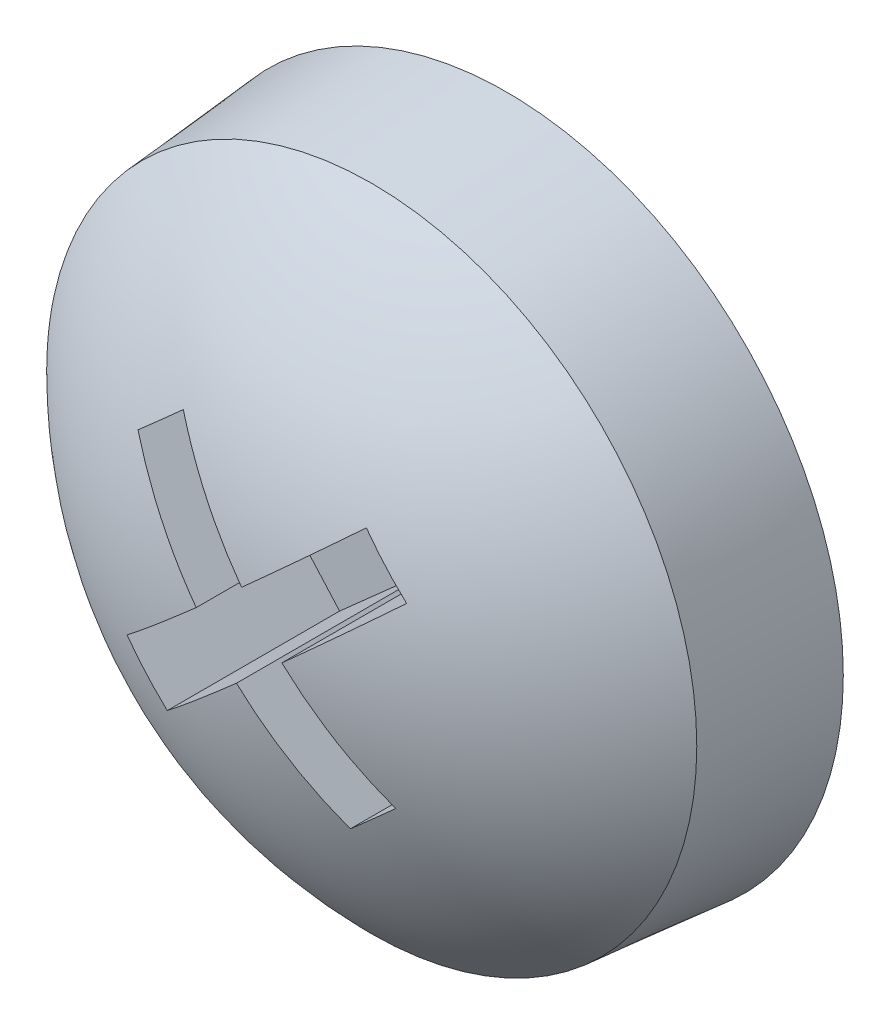
ISO-10303-21;
HEADER;
FILE_DESCRIPTION(('STEP AP214'),'2;1');
FILE_NAME('part.step','',(''),(''),'','','');
FILE_SCHEMA(('AUTOMOTIVE_DESIGN { 1 0 10303 214 1 1 1 1 }'));
ENDSEC;
DATA;
#1=APPLICATION_CONTEXT('core data for automotive mechanical design processes');
#2=APPLICATION_PROTOCOL_DEFINITION('international standard','automotive_design',2000,#1);
#3=PRODUCT_CONTEXT('',#1,'mechanical');
#4=PRODUCT('Part','Part','',(#3));
#5=PRODUCT_RELATED_PRODUCT_CATEGORY('part','',(#4));
#6=PRODUCT_DEFINITION_FORMATION('','',#4);
#7=PRODUCT_DEFINITION_CONTEXT('part definition',#1,'design');
#8=PRODUCT_DEFINITION('design','',#6,#7);
#9=PRODUCT_DEFINITION_SHAPE('','',#8);
#10=(LENGTH_UNIT() NAMED_UNIT(*) SI_UNIT(.MILLI.,.METRE.));
#11=(NAMED_UNIT(*) PLANE_ANGLE_UNIT() SI_UNIT($,.RADIAN.));
#12=(NAMED_UNIT(*) SI_UNIT($,.STERADIAN.) SOLID_ANGLE_UNIT());
#13=UNCERTAINTY_MEASURE_WITH_UNIT(LENGTH_MEASURE(1.E-05),#10,'distance_accuracy_value','');
#14=(GEOMETRIC_REPRESENTATION_CONTEXT(3) GLOBAL_UNCERTAINTY_ASSIGNED_CONTEXT((#13)) GLOBAL_UNIT_ASSIGNED_CONTEXT((#10,
#11,#12)) REPRESENTATION_CONTEXT('',''));
#15=CARTESIAN_POINT('',(0.,0.,0.));
#16=DIRECTION('',(0.,0.,1.));
#17=DIRECTION('',(1.,0.,0.));
#18=AXIS2_PLACEMENT_3D('',#15,#16,#17);
#19=CARTESIAN_POINT('',(-6.90000000000015,4.50499199787339,21.6));
#20=DIRECTION('',(0.,0.,1.));
#21=DIRECTION('',(0.,-1.,0.));
#22=AXIS2_PLACEMENT_3D('',#19,#20,#21);
#23=PLANE('',#22);
#24=DIRECTION('',(0.747876143588401,0.66383828893138,0.));
#25=VECTOR('',#24,1.);
#26=CARTESIAN_POINT('',(-7.0194908920078,4.6396097037193,21.6));
#27=LINE('',#26,#25);
#28=CARTESIAN_POINT('',(-6.88487318616189,4.75910059572695,21.6));
#29=VERTEX_POINT('',#28);
#30=CARTESIAN_POINT('',(-6.30900855559882,5.27025607820411,21.6));
#31=VERTEX_POINT('',#30);
#32=EDGE_CURVE('E84',#29,#31,#27,.T.);
#33=ORIENTED_EDGE('',*,*,#32,.F.);
#34=DIRECTION('',(0.66383828893138,-0.747876143588401,0.));
#35=VECTOR('',#34,1.);
#36=CARTESIAN_POINT('',(-6.76538229415424,4.62448288988104,21.6));
#37=LINE('',#36,#35);
#38=CARTESIAN_POINT('',(-7.39602866863905,5.33496522629002,21.6));
#39=VERTEX_POINT('',#38);
#40=EDGE_CURVE('E89',#39,#29,#37,.T.);
#41=ORIENTED_EDGE('',*,*,#40,.F.);
#42=DIRECTION('',(0.747876143588401,0.66383828893138,0.));
#43=VECTOR('',#42,1.);
#44=CARTESIAN_POINT('',(-7.53064637448496,5.21547433428237,21.6));
#45=LINE('',#44,#43);
#46=CARTESIAN_POINT('',(-7.66526408033088,5.09598344227472,21.6));
#47=VERTEX_POINT('',#46);
#48=EDGE_CURVE('E140',#47,#39,#45,.T.);
#49=ORIENTED_EDGE('',*,*,#48,.F.);
#50=DIRECTION('',(-0.66383828893138,0.747876143588401,0.));
#51=VECTOR('',#50,1.);
#52=CARTESIAN_POINT('',(-7.03461770584607,4.38550110586574,21.6));
#53=LINE('',#52,#51);
#54=CARTESIAN_POINT('',(-7.15410859785371,4.52011881171165,21.6));
#55=VERTEX_POINT('',#54);
#56=EDGE_CURVE('E151',#55,#47,#53,.T.);
#57=ORIENTED_EDGE('',*,*,#56,.F.);
#58=DIRECTION('',(0.747876143588401,0.66383828893138,0.));
#59=VECTOR('',#58,1.);
#60=CARTESIAN_POINT('',(-7.0194908920078,4.6396097037193,21.6));
#61=LINE('',#60,#59);
#62=CARTESIAN_POINT('',(-7.72997322841678,4.00896332923449,21.6));
#63=VERTEX_POINT('',#62);
#64=EDGE_CURVE('E154',#63,#55,#61,.T.);
#65=ORIENTED_EDGE('',*,*,#64,.F.);
#66=DIRECTION('',(-0.66383828893138,0.747876143588401,0.));
#67=VECTOR('',#66,1.);
#68=CARTESIAN_POINT('',(-7.61048233640913,3.87434562338858,21.6));
#69=LINE('',#68,#67);
#70=CARTESIAN_POINT('',(-7.49099144440148,3.73972791754267,21.6));
#71=VERTEX_POINT('',#70);
#72=EDGE_CURVE('E162',#71,#63,#69,.T.);
#73=ORIENTED_EDGE('',*,*,#72,.F.);
#74=DIRECTION('',(-0.747876143588401,-0.66383828893138,0.));
#75=VECTOR('',#74,1.);
#76=CARTESIAN_POINT('',(-6.7805091079925,4.37037429202748,21.6));
#77=LINE('',#76,#75);
#78=CARTESIAN_POINT('',(-6.91512681383842,4.25088340001983,21.6));
#79=VERTEX_POINT('',#78);
#80=EDGE_CURVE('E167',#79,#71,#77,.T.);
#81=ORIENTED_EDGE('',*,*,#80,.F.);
#82=DIRECTION('',(-0.66383828893138,0.747876143588401,0.));
#83=VECTOR('',#82,1.);
#84=CARTESIAN_POINT('',(-7.03461770584607,4.38550110586574,21.6));
#85=LINE('',#84,#83);
#86=CARTESIAN_POINT('',(-6.40397133136126,3.67501876945676,21.6));
#87=VERTEX_POINT('',#86);
#88=EDGE_CURVE('E172',#87,#79,#85,.T.);
#89=ORIENTED_EDGE('',*,*,#88,.F.);
#90=DIRECTION('',(0.747876143588401,0.66383828893138,0.));
#91=VECTOR('',#90,1.);
#92=CARTESIAN_POINT('',(-6.26935362551535,3.79450966146441,21.6));
#93=LINE('',#92,#91);
#94=CARTESIAN_POINT('',(-6.13473591966944,3.91400055347207,21.6));
#95=VERTEX_POINT('',#94);
#96=EDGE_CURVE('E178',#87,#95,#93,.T.);
#97=ORIENTED_EDGE('',*,*,#96,.T.);
#98=DIRECTION('',(0.66383828893138,-0.747876143588401,0.));
#99=VECTOR('',#98,1.);
#100=CARTESIAN_POINT('',(-6.76538229415424,4.62448288988104,21.6));
#101=LINE('',#100,#99);
#102=CARTESIAN_POINT('',(-6.64589140214659,4.48986518403512,21.6));
#103=VERTEX_POINT('',#102);
#104=EDGE_CURVE('E183',#103,#95,#101,.T.);
#105=ORIENTED_EDGE('',*,*,#104,.F.);
#106=DIRECTION('',(-0.747876143588401,-0.66383828893138,0.));
#107=VECTOR('',#106,1.);
#108=CARTESIAN_POINT('',(-6.7805091079925,4.37037429202748,21.6));
#109=LINE('',#108,#107);
#110=CARTESIAN_POINT('',(-6.07002677158353,5.00102066651228,21.6));
#111=VERTEX_POINT('',#110);
#112=EDGE_CURVE('E119',#111,#103,#109,.T.);
#113=ORIENTED_EDGE('',*,*,#112,.F.);
#114=DIRECTION('',(-0.66383828893138,0.747876143588401,0.));
#115=VECTOR('',#114,1.);
#116=CARTESIAN_POINT('',(-6.18951766359117,5.1356383723582,21.6));
#117=LINE('',#116,#115);
#118=EDGE_CURVE('E117',#111,#31,#117,.T.);
#119=ORIENTED_EDGE('',*,*,#118,.T.);
#120=EDGE_LOOP('',(#33,#41,#49,#57,#65,#73,#81,#89,#97,#105,#113,#119));
#121=FACE_BOUND('',#120,.T.);
#122=ADVANCED_FACE('F17',(#121),#23,.T.);
#123=CARTESIAN_POINT('',(-7.0194908920078,4.6396097037193,22.2));
#124=DIRECTION('',(0.66383828893138,-0.747876143588401,0.));
#125=DIRECTION('',(0.747876143588401,0.66383828893138,0.));
#126=AXIS2_PLACEMENT_3D('',#123,#124,#125);
#127=PLANE('',#126);
#128=DIRECTION('',(0.,0.,1.));
#129=VECTOR('',#128,1.);
#130=CARTESIAN_POINT('',(-6.88487318616189,4.75910059572695,22.2));
#131=LINE('',#130,#129);
#132=CARTESIAN_POINT('',(-6.88487318616189,4.75910059572695,22.788097569794));
#133=VERTEX_POINT('',#132);
#134=EDGE_CURVE('E127',#29,#133,#131,.T.);
#135=ORIENTED_EDGE('',*,*,#134,.F.);
#136=ORIENTED_EDGE('',*,*,#32,.T.);
#137=DIRECTION('',(0.,0.,1.));
#138=VECTOR('',#137,1.);
#139=CARTESIAN_POINT('',(-6.30900855559882,5.27025607820411,22.2));
#140=LINE('',#139,#138);
#141=CARTESIAN_POINT('',(-6.30900855559882,5.27025607820411,22.6229045231911));
#142=VERTEX_POINT('',#141);
#143=EDGE_CURVE('E123',#31,#142,#140,.T.);
#144=ORIENTED_EDGE('',*,*,#143,.T.);
#145=CARTESIAN_POINT('',(-6.88487318616188,4.75910059572695,22.788097569794));
#146=CARTESIAN_POINT('',(-6.86018725238199,4.78101260372668,22.7859104299673));
#147=CARTESIAN_POINT('',(-6.83553118762501,4.80289809904616,22.7831210421487));
#148=CARTESIAN_POINT('',(-6.78640820570417,4.84650119635726,22.7763560552392));
#149=CARTESIAN_POINT('',(-6.76194092600565,4.868219120146,22.7723851623111));
#150=CARTESIAN_POINT('',(-6.71319426733734,4.91148818115152,22.7632701136372));
#151=CARTESIAN_POINT('',(-6.68891456403112,4.93303960625946,22.7581290588921));
#152=CARTESIAN_POINT('',(-6.64054218782471,4.97597644242906,22.7466823115268));
#153=CARTESIAN_POINT('',(-6.61644931068595,4.99736203477927,22.7403781619621));
#154=CARTESIAN_POINT('',(-6.56844981562365,5.03996788996652,22.7266089835755));
#155=CARTESIAN_POINT('',(-6.54454319770011,5.06118815280357,22.7191439547536));
#156=CARTESIAN_POINT('',(-6.4969160965814,5.10346345946291,22.703052205587));
#157=CARTESIAN_POINT('',(-6.47319590048996,5.12451824844295,22.6944239659575));
#158=CARTESIAN_POINT('',(-6.42594275839351,5.16646161736154,22.6760004253173));
#159=CARTESIAN_POINT('',(-6.40241046789994,5.1873496154476,22.666202118307));
#160=CARTESIAN_POINT('',(-6.35553505693748,5.22895769838091,22.6454289197685));
#161=CARTESIAN_POINT('',(-6.332193049565,5.24967679520893,22.6344495373844));
#162=CARTESIAN_POINT('',(-6.30900855559883,5.2702560782041,22.622904523191));
#163=B_SPLINE_CURVE_WITH_KNOTS('',3,(#145,#146,#147,#148,#149,#150,#151,#152,#153,#154,#155,
#156,#157,#158,#159,#160,#161,#162),.UNSPECIFIED.,.F.,.F.,(4,2,2,2,2,2,2,2,4),(0.,
0.0992357442434154,0.198081387639264,0.296668072480489,0.395124892694087,0.493581712907685,
0.592168397748909,0.691014041144759,0.790249785388174),.UNSPECIFIED.);
#164=EDGE_CURVE('E20',#133,#142,#163,.T.);
#165=ORIENTED_EDGE('',*,*,#164,.F.);
#166=EDGE_LOOP('',(#135,#136,#144,#165));
#167=FACE_BOUND('',#166,.T.);
#168=ADVANCED_FACE('F125',(#167),#127,.T.);
#169=CARTESIAN_POINT('',(-6.18951766359117,5.1356383723582,22.2));
#170=DIRECTION('',(0.747876143588401,0.66383828893138,0.));
#171=DIRECTION('',(-0.66383828893138,0.747876143588401,0.));
#172=AXIS2_PLACEMENT_3D('',#169,#170,#171);
#173=PLANE('',#172);
#174=ORIENTED_EDGE('',*,*,#118,.F.);
#175=DIRECTION('',(0.,0.,1.));
#176=VECTOR('',#175,1.);
#177=CARTESIAN_POINT('',(-6.07002677158353,5.00102066651228,22.2));
#178=LINE('',#177,#176);
#179=CARTESIAN_POINT('',(-6.07002677158354,5.00102066651227,22.6229045231911));
#180=VERTEX_POINT('',#179);
#181=EDGE_CURVE('E132',#180,#111,#178,.F.);
#182=ORIENTED_EDGE('',*,*,#181,.F.);
#183=CARTESIAN_POINT('',(-6.30900855559881,5.27025607820411,22.622904523191));
#184=CARTESIAN_POINT('',(-6.26917825826292,5.22538350958884,22.6271329188894));
#185=CARTESIAN_POINT('',(-6.22934796092705,5.18051094097354,22.6292471167385));
#186=CARTESIAN_POINT('',(-6.14968736625535,5.09076580374292,22.6292471167385));
#187=CARTESIAN_POINT('',(-6.10985706891952,5.04589323512759,22.6271329188894));
#188=CARTESIAN_POINT('',(-6.0700267715837,5.00102066651225,22.6229045231911));
#189=B_SPLINE_CURVE_WITH_KNOTS('',3,(#183,#184,#185,#186,#187,#188),.UNSPECIFIED.,.F.,.F.,(4,2,
4),(0.,0.180111711148641,0.360223422297283),.UNSPECIFIED.);
#190=EDGE_CURVE('E131',#142,#180,#189,.T.);
#191=ORIENTED_EDGE('',*,*,#190,.F.);
#192=ORIENTED_EDGE('',*,*,#143,.F.);
#193=EDGE_LOOP('',(#174,#182,#191,#192));
#194=FACE_BOUND('',#193,.T.);
#195=ADVANCED_FACE('F129',(#194),#173,.F.);
#196=CARTESIAN_POINT('',(-6.7805091079925,4.37037429202748,22.2));
#197=DIRECTION('',(-0.66383828893138,0.747876143588401,0.));
#198=DIRECTION('',(-0.747876143588401,-0.66383828893138,0.));
#199=AXIS2_PLACEMENT_3D('',#196,#197,#198);
#200=PLANE('',#199);
#201=DIRECTION('',(0.,0.,1.));
#202=VECTOR('',#201,1.);
#203=CARTESIAN_POINT('',(-6.64589140214659,4.48986518403512,22.2));
#204=LINE('',#203,#202);
#205=CARTESIAN_POINT('',(-6.64589140214659,4.48986518403512,22.788097569794));
#206=VERTEX_POINT('',#205);
#207=EDGE_CURVE('E180',#206,#103,#204,.F.);
#208=ORIENTED_EDGE('',*,*,#207,.F.);
#209=CARTESIAN_POINT('',(-6.07002677158354,5.00102066651227,22.622904523191));
#210=CARTESIAN_POINT('',(-6.09321126554971,4.9804413835171,22.6344495373844));
#211=CARTESIAN_POINT('',(-6.11655327292219,4.95972228668908,22.6454289197685));
#212=CARTESIAN_POINT('',(-6.16342868388464,4.91811420375578,22.666202118307));
#213=CARTESIAN_POINT('',(-6.18696097437822,4.89722620566971,22.6760004253173));
#214=CARTESIAN_POINT('',(-6.23421411647466,4.85528283675112,22.6944239659575));
#215=CARTESIAN_POINT('',(-6.25793431256611,4.83422804777108,22.703052205587));
#216=CARTESIAN_POINT('',(-6.30556141368481,4.79195274111174,22.7191439547536));
#217=CARTESIAN_POINT('',(-6.32946803160836,4.7707324782747,22.7266089835755));
#218=CARTESIAN_POINT('',(-6.37746752667066,4.72812662308744,22.7403781619621));
#219=CARTESIAN_POINT('',(-6.40156040380942,4.70674103073723,22.7466823115268));
#220=CARTESIAN_POINT('',(-6.44993278001582,4.66380419456764,22.7581290588921));
#221=CARTESIAN_POINT('',(-6.47421248332205,4.64225276945969,22.7632701136372));
#222=CARTESIAN_POINT('',(-6.52295914199036,4.59898370845418,22.7723851623111));
#223=CARTESIAN_POINT('',(-6.54742642168888,4.57726578466544,22.7763560552392));
#224=CARTESIAN_POINT('',(-6.59654940360971,4.53366268735434,22.7831210421487));
#225=CARTESIAN_POINT('',(-6.6212054683667,4.51177719203486,22.7859104299673));
#226=CARTESIAN_POINT('',(-6.64589140214659,4.48986518403512,22.788097569794));
#227=B_SPLINE_CURVE_WITH_KNOTS('',3,(#209,#210,#211,#212,#213,#214,#215,#216,#217,#218,#219,
#220,#221,#222,#223,#224,#225,#226),.UNSPECIFIED.,.F.,.F.,(4,2,2,2,2,2,2,2,4),(0.,
0.0992357442434141,0.198081387639263,0.296668072480486,0.395124892694084,0.493581712907682,
0.592168397748907,0.691014041144756,0.79024978538817),.UNSPECIFIED.);
#228=EDGE_CURVE('E296',#180,#206,#227,.T.);
#229=ORIENTED_EDGE('',*,*,#228,.F.);
#230=ORIENTED_EDGE('',*,*,#181,.T.);
#231=ORIENTED_EDGE('',*,*,#112,.T.);
#232=EDGE_LOOP('',(#208,#229,#230,#231));
#233=FACE_BOUND('',#232,.T.);
#234=ADVANCED_FACE('F305',(#233),#200,.T.);
#235=CARTESIAN_POINT('',(-6.76538229415424,4.62448288988104,22.2));
#236=DIRECTION('',(-0.747876143588401,-0.66383828893138,0.));
#237=DIRECTION('',(0.66383828893138,-0.747876143588401,0.));
#238=AXIS2_PLACEMENT_3D('',#235,#236,#237);
#239=PLANE('',#238);
#240=CARTESIAN_POINT('',(-6.64589140214659,4.48986518403512,22.788097569794));
#241=CARTESIAN_POINT('',(-6.62397939414685,4.46517925025523,22.7859104299673));
#242=CARTESIAN_POINT('',(-6.60209389882737,4.44052318549825,22.7831210421487));
#243=CARTESIAN_POINT('',(-6.55849080151628,4.39140020357741,22.7763560552392));
#244=CARTESIAN_POINT('',(-6.53677287772753,4.36693292387889,22.7723851623111));
#245=CARTESIAN_POINT('',(-6.49350381672202,4.31818626521058,22.7632701136372));
#246=CARTESIAN_POINT('',(-6.47195239161407,4.29390656190436,22.7581290588921));
#247=CARTESIAN_POINT('',(-6.42901555544448,4.24553418569795,22.7466823115268));
#248=CARTESIAN_POINT('',(-6.40762996309427,4.22144130855919,22.740378161962));
#249=CARTESIAN_POINT('',(-6.36502410790701,4.17344181349689,22.7266089835755));
#250=CARTESIAN_POINT('',(-6.34380384506997,4.14953519557335,22.7191439547536));
#251=CARTESIAN_POINT('',(-6.30152853841063,4.10190809445464,22.703052205587));
#252=CARTESIAN_POINT('',(-6.28047374943059,4.0781878983632,22.6944239659575));
#253=CARTESIAN_POINT('',(-6.23853038051201,4.03093475626675,22.6760004253173));
#254=CARTESIAN_POINT('',(-6.21764238242594,4.00740246577318,22.666202118307));
#255=CARTESIAN_POINT('',(-6.17603429949263,3.96052705481073,22.6454289197685));
#256=CARTESIAN_POINT('',(-6.15531520266462,3.93718504743825,22.6344495373844));
#257=CARTESIAN_POINT('',(-6.13473591966945,3.91400055347208,22.622904523191));
#258=B_SPLINE_CURVE_WITH_KNOTS('',3,(#240,#241,#242,#243,#244,#245,#246,#247,#248,#249,#250,
#251,#252,#253,#254,#255,#256,#257),.UNSPECIFIED.,.F.,.F.,(4,2,2,2,2,2,2,2,4),(0.,
0.0992357442434136,0.198081387639262,0.296668072480486,0.395124892694082,0.49358171290768,
0.592168397748903,0.691014041144751,0.790249785388165),.UNSPECIFIED.);
#259=CARTESIAN_POINT('',(-6.13473591966943,3.91400055347206,22.6229045231911));
#260=VERTEX_POINT('',#259);
#261=EDGE_CURVE('E289',#206,#260,#258,.T.);
#262=ORIENTED_EDGE('',*,*,#261,.F.);
#263=ORIENTED_EDGE('',*,*,#207,.T.);
#264=ORIENTED_EDGE('',*,*,#104,.T.);
#265=DIRECTION('',(0.,0.,1.));
#266=VECTOR('',#265,1.);
#267=CARTESIAN_POINT('',(-6.13473591966943,3.91400055347206,22.2));
#268=LINE('',#267,#266);
#269=EDGE_CURVE('E175',#95,#260,#268,.T.);
#270=ORIENTED_EDGE('',*,*,#269,.T.);
#271=EDGE_LOOP('',(#262,#263,#264,#270));
#272=FACE_BOUND('',#271,.T.);
#273=ADVANCED_FACE('F302',(#272),#239,.T.);
#274=CARTESIAN_POINT('',(-6.26935362551535,3.79450966146441,22.2));
#275=DIRECTION('',(0.66383828893138,-0.747876143588401,0.));
#276=DIRECTION('',(0.747876143588401,0.66383828893138,0.));
#277=AXIS2_PLACEMENT_3D('',#274,#275,#276);
#278=PLANE('',#277);
#279=ORIENTED_EDGE('',*,*,#96,.F.);
#280=DIRECTION('',(0.,0.,1.));
#281=VECTOR('',#280,1.);
#282=CARTESIAN_POINT('',(-6.40397133136126,3.67501876945676,22.2));
#283=LINE('',#282,#281);
#284=CARTESIAN_POINT('',(-6.40397133136127,3.67501876945677,22.6229045231911));
#285=VERTEX_POINT('',#284);
#286=EDGE_CURVE('E174',#285,#87,#283,.F.);
#287=ORIENTED_EDGE('',*,*,#286,.F.);
#288=CARTESIAN_POINT('',(-6.13473591966944,3.91400055347206,22.622904523191));
#289=CARTESIAN_POINT('',(-6.17960848828474,3.87417025613618,22.6271329188894));
#290=CARTESIAN_POINT('',(-6.22448105690004,3.83433995880029,22.6292471167385));
#291=CARTESIAN_POINT('',(-6.31422619413065,3.75467936412853,22.6292471167385));
#292=CARTESIAN_POINT('',(-6.35909876274595,3.71484906679265,22.6271329188894));
#293=CARTESIAN_POINT('',(-6.40397133136126,3.67501876945677,22.622904523191));
#294=B_SPLINE_CURVE_WITH_KNOTS('',3,(#288,#289,#290,#291,#292,#293),.UNSPECIFIED.,.F.,.F.,(4,2,
4),(0.,0.180111711148687,0.360223422297372),.UNSPECIFIED.);
#295=EDGE_CURVE('E282',#260,#285,#294,.T.);
#296=ORIENTED_EDGE('',*,*,#295,.F.);
#297=ORIENTED_EDGE('',*,*,#269,.F.);
#298=EDGE_LOOP('',(#279,#287,#296,#297));
#299=FACE_BOUND('',#298,.T.);
#300=ADVANCED_FACE('F271',(#299),#278,.F.);
#301=CARTESIAN_POINT('',(-7.03461770584607,4.38550110586574,22.2));
#302=DIRECTION('',(0.747876143588401,0.66383828893138,0.));
#303=DIRECTION('',(-0.66383828893138,0.747876143588401,0.));
#304=AXIS2_PLACEMENT_3D('',#301,#302,#303);
#305=PLANE('',#304);
#306=CARTESIAN_POINT('',(-6.40397133136128,3.67501876945678,22.622904523191));
#307=CARTESIAN_POINT('',(-6.42455061435645,3.69820326342295,22.6344495373844));
#308=CARTESIAN_POINT('',(-6.44526971118446,3.72154527079543,22.6454289197685));
#309=CARTESIAN_POINT('',(-6.48687779411777,3.76842068175788,22.666202118307));
#310=CARTESIAN_POINT('',(-6.50776579220384,3.79195297225145,22.6760004253173));
#311=CARTESIAN_POINT('',(-6.54970916112242,3.8392061143479,22.6944239659575));
#312=CARTESIAN_POINT('',(-6.57076395010246,3.86292631043934,22.703052205587));
#313=CARTESIAN_POINT('',(-6.6130392567618,3.91055341155805,22.7191439547536));
#314=CARTESIAN_POINT('',(-6.63425951959885,3.93446002948159,22.7266089835755));
#315=CARTESIAN_POINT('',(-6.6768653747861,3.9824595245439,22.740378161962));
#316=CARTESIAN_POINT('',(-6.69825096713631,4.00655240168266,22.7466823115268));
#317=CARTESIAN_POINT('',(-6.74118780330591,4.05492477788906,22.7581290588921));
#318=CARTESIAN_POINT('',(-6.76273922841385,4.07920448119528,22.7632701136372));
#319=CARTESIAN_POINT('',(-6.80600828941937,4.1279511398636,22.7723851623111));
#320=CARTESIAN_POINT('',(-6.82772621320811,4.15241841956212,22.7763560552392));
#321=CARTESIAN_POINT('',(-6.87132931051921,4.20154140148295,22.7831210421487));
#322=CARTESIAN_POINT('',(-6.89321480583869,4.22619746623993,22.7859104299673));
#323=CARTESIAN_POINT('',(-6.91512681383842,4.25088340001983,22.788097569794));
#324=B_SPLINE_CURVE_WITH_KNOTS('',3,(#306,#307,#308,#309,#310,#311,#312,#313,#314,#315,#316,
#317,#318,#319,#320,#321,#322,#323),.UNSPECIFIED.,.F.,.F.,(4,2,2,2,2,2,2,2,4),(0.,
0.099235744243414,0.198081387639263,0.296668072480486,0.395124892694086,0.493581712907683,
0.592168397748909,0.691014041144756,0.790249785388172),.UNSPECIFIED.);
#325=CARTESIAN_POINT('',(-6.91512681383842,4.25088340001983,22.788097569794));
#326=VERTEX_POINT('',#325);
#327=EDGE_CURVE('E275',#285,#326,#324,.T.);
#328=ORIENTED_EDGE('',*,*,#327,.F.);
#329=ORIENTED_EDGE('',*,*,#286,.T.);
#330=ORIENTED_EDGE('',*,*,#88,.T.);
#331=DIRECTION('',(0.,0.,1.));
#332=VECTOR('',#331,1.);
#333=CARTESIAN_POINT('',(-6.91512681383842,4.25088340001983,22.2));
#334=LINE('',#333,#332);
#335=EDGE_CURVE('E169',#326,#79,#334,.F.);
#336=ORIENTED_EDGE('',*,*,#335,.F.);
#337=EDGE_LOOP('',(#328,#329,#330,#336));
#338=FACE_BOUND('',#337,.T.);
#339=ADVANCED_FACE('F266',(#338),#305,.T.);
#340=CARTESIAN_POINT('',(-6.7805091079925,4.37037429202748,22.2));
#341=DIRECTION('',(-0.66383828893138,0.747876143588401,0.));
#342=DIRECTION('',(-0.747876143588401,-0.66383828893138,0.));
#343=AXIS2_PLACEMENT_3D('',#340,#341,#342);
#344=PLANE('',#343);
#345=ORIENTED_EDGE('',*,*,#335,.T.);
#346=ORIENTED_EDGE('',*,*,#80,.T.);
#347=DIRECTION('',(0.,0.,1.));
#348=VECTOR('',#347,1.);
#349=CARTESIAN_POINT('',(-7.49099144440148,3.73972791754267,22.2));
#350=LINE('',#349,#348);
#351=CARTESIAN_POINT('',(-7.49099144440148,3.73972791754267,22.6229045231911));
#352=VERTEX_POINT('',#351);
#353=EDGE_CURVE('E164',#352,#71,#350,.F.);
#354=ORIENTED_EDGE('',*,*,#353,.F.);
#355=CARTESIAN_POINT('',(-6.91512681383842,4.25088340001983,22.788097569794));
#356=CARTESIAN_POINT('',(-6.93981274761831,4.22897139202009,22.7859104299673));
#357=CARTESIAN_POINT('',(-6.96446881237529,4.20708589670061,22.7831210421487));
#358=CARTESIAN_POINT('',(-7.01359179429613,4.16348279938951,22.7763560552392));
#359=CARTESIAN_POINT('',(-7.03805907399465,4.14176487560077,22.7723851623111));
#360=CARTESIAN_POINT('',(-7.08680573266296,4.09849581459526,22.7632701136372));
#361=CARTESIAN_POINT('',(-7.11108543596918,4.07694438948731,22.7581290588921));
#362=CARTESIAN_POINT('',(-7.15945781217559,4.03400755331772,22.7466823115268));
#363=CARTESIAN_POINT('',(-7.18355068931435,4.01262196096751,22.740378161962));
#364=CARTESIAN_POINT('',(-7.23155018437665,3.97001610578025,22.7266089835755));
#365=CARTESIAN_POINT('',(-7.25545680230019,3.94879584294321,22.7191439547536));
#366=CARTESIAN_POINT('',(-7.3030839034189,3.90652053628387,22.703052205587));
#367=CARTESIAN_POINT('',(-7.32680409951034,3.88546574730383,22.6944239659575));
#368=CARTESIAN_POINT('',(-7.37405724160679,3.84352237838524,22.6760004253173));
#369=CARTESIAN_POINT('',(-7.39758953210036,3.82263438029918,22.666202118307));
#370=CARTESIAN_POINT('',(-7.44446494306281,3.78102629736587,22.6454289197685));
#371=CARTESIAN_POINT('',(-7.46780695043529,3.76030720053786,22.6344495373844));
#372=CARTESIAN_POINT('',(-7.49099144440146,3.73972791754268,22.622904523191));
#373=B_SPLINE_CURVE_WITH_KNOTS('',3,(#355,#356,#357,#358,#359,#360,#361,#362,#363,#364,#365,
#366,#367,#368,#369,#370,#371,#372),.UNSPECIFIED.,.F.,.F.,(4,2,2,2,2,2,2,2,4),(0.,
0.0992357442434149,0.198081387639262,0.296668072480486,0.395124892694082,0.493581712907681,
0.592168397748905,0.691014041144753,0.790249785388167),.UNSPECIFIED.);
#374=EDGE_CURVE('E251',#326,#352,#373,.T.);
#375=ORIENTED_EDGE('',*,*,#374,.F.);
#376=EDGE_LOOP('',(#345,#346,#354,#375));
#377=FACE_BOUND('',#376,.T.);
#378=ADVANCED_FACE('F261',(#377),#344,.T.);
#379=CARTESIAN_POINT('',(-7.61048233640913,3.87434562338858,22.2));
#380=DIRECTION('',(0.747876143588401,0.66383828893138,0.));
#381=DIRECTION('',(-0.66383828893138,0.747876143588401,0.));
#382=AXIS2_PLACEMENT_3D('',#379,#380,#381);
#383=PLANE('',#382);
#384=ORIENTED_EDGE('',*,*,#353,.T.);
#385=ORIENTED_EDGE('',*,*,#72,.T.);
#386=DIRECTION('',(0.,0.,1.));
#387=VECTOR('',#386,1.);
#388=CARTESIAN_POINT('',(-7.72997322841678,4.00896332923449,22.2));
#389=LINE('',#388,#387);
#390=CARTESIAN_POINT('',(-7.72997322841677,4.0089633292345,22.6229045231911));
#391=VERTEX_POINT('',#390);
#392=EDGE_CURVE('E159',#391,#63,#389,.F.);
#393=ORIENTED_EDGE('',*,*,#392,.F.);
#394=CARTESIAN_POINT('',(-7.49099144440148,3.73972791754267,22.622904523191));
#395=CARTESIAN_POINT('',(-7.53082174173737,3.78460048615797,22.6271329188894));
#396=CARTESIAN_POINT('',(-7.57065203907325,3.82947305477328,22.6292471167385));
#397=CARTESIAN_POINT('',(-7.65031263374502,3.91921819200389,22.6292471167385));
#398=CARTESIAN_POINT('',(-7.6901429310809,3.9640907606192,22.6271329188894));
#399=CARTESIAN_POINT('',(-7.72997322841678,4.0089633292345,22.622904523191));
#400=B_SPLINE_CURVE_WITH_KNOTS('',3,(#394,#395,#396,#397,#398,#399),.UNSPECIFIED.,.F.,.F.,(4,2,
4),(0.,0.180111711148691,0.360223422297383),.UNSPECIFIED.);
#401=EDGE_CURVE('E244',#352,#391,#400,.T.);
#402=ORIENTED_EDGE('',*,*,#401,.F.);
#403=EDGE_LOOP('',(#384,#385,#393,#402));
#404=FACE_BOUND('',#403,.T.);
#405=ADVANCED_FACE('F258',(#404),#383,.T.);
#406=CARTESIAN_POINT('',(-7.0194908920078,4.6396097037193,22.2));
#407=DIRECTION('',(0.66383828893138,-0.747876143588401,0.));
#408=DIRECTION('',(0.747876143588401,0.66383828893138,0.));
#409=AXIS2_PLACEMENT_3D('',#406,#407,#408);
#410=PLANE('',#409);
#411=DIRECTION('',(0.,0.,1.));
#412=VECTOR('',#411,1.);
#413=CARTESIAN_POINT('',(-7.15410859785371,4.52011881171165,22.2));
#414=LINE('',#413,#412);
#415=CARTESIAN_POINT('',(-7.15410859785371,4.52011881171165,22.788097569794));
#416=VERTEX_POINT('',#415);
#417=EDGE_CURVE('E143',#416,#55,#414,.F.);
#418=ORIENTED_EDGE('',*,*,#417,.F.);
#419=CARTESIAN_POINT('',(-7.72997322841676,4.0089633292345,22.622904523191));
#420=CARTESIAN_POINT('',(-7.70678873445059,4.02954261222968,22.6344495373844));
#421=CARTESIAN_POINT('',(-7.68344672707811,4.05026170905769,22.6454289197685));
#422=CARTESIAN_POINT('',(-7.63657131611566,4.091869791991,22.666202118307));
#423=CARTESIAN_POINT('',(-7.61303902562209,4.11275779007707,22.6760004253173));
#424=CARTESIAN_POINT('',(-7.56578588352564,4.15470115899565,22.6944239659575));
#425=CARTESIAN_POINT('',(-7.54206568743419,4.17575594797569,22.703052205587));
#426=CARTESIAN_POINT('',(-7.49443858631549,4.21803125463503,22.7191439547536));
#427=CARTESIAN_POINT('',(-7.47053196839195,4.23925151747208,22.7266089835755));
#428=CARTESIAN_POINT('',(-7.42253247332965,4.28185737265933,22.740378161962));
#429=CARTESIAN_POINT('',(-7.39843959619089,4.30324296500954,22.7466823115268));
#430=CARTESIAN_POINT('',(-7.35006721998448,4.34617980117913,22.7581290588921));
#431=CARTESIAN_POINT('',(-7.32578751667826,4.36773122628708,22.7632701136372));
#432=CARTESIAN_POINT('',(-7.27704085800994,4.41100028729259,22.7723851623111));
#433=CARTESIAN_POINT('',(-7.25257357831142,4.43271821108134,22.7763560552392));
#434=CARTESIAN_POINT('',(-7.20345059639059,4.47632130839243,22.7831210421487));
#435=CARTESIAN_POINT('',(-7.17879453163361,4.49820680371192,22.7859104299673));
#436=CARTESIAN_POINT('',(-7.15410859785371,4.52011881171165,22.788097569794));
#437=B_SPLINE_CURVE_WITH_KNOTS('',3,(#419,#420,#421,#422,#423,#424,#425,#426,#427,#428,#429,
#430,#431,#432,#433,#434,#435,#436),.UNSPECIFIED.,.F.,.F.,(4,2,2,2,2,2,2,2,4),(0.,
0.0992357442434134,0.198081387639264,0.296668072480486,0.395124892694085,0.493581712907682,
0.592168397748907,0.691014041144754,0.79024978538817),.UNSPECIFIED.);
#438=EDGE_CURVE('E237',#391,#416,#437,.T.);
#439=ORIENTED_EDGE('',*,*,#438,.F.);
#440=ORIENTED_EDGE('',*,*,#392,.T.);
#441=ORIENTED_EDGE('',*,*,#64,.T.);
#442=EDGE_LOOP('',(#418,#439,#440,#441));
#443=FACE_BOUND('',#442,.T.);
#444=ADVANCED_FACE('F226',(#443),#410,.T.);
#445=CARTESIAN_POINT('',(-7.03461770584607,4.38550110586574,22.2));
#446=DIRECTION('',(0.747876143588401,0.66383828893138,0.));
#447=DIRECTION('',(-0.66383828893138,0.747876143588401,0.));
#448=AXIS2_PLACEMENT_3D('',#445,#446,#447);
#449=PLANE('',#448);
#450=CARTESIAN_POINT('',(-7.15410859785371,4.52011881171165,22.788097569794));
#451=CARTESIAN_POINT('',(-7.17602060585345,4.54480474549154,22.7859104299673));
#452=CARTESIAN_POINT('',(-7.19790610117293,4.56946081024852,22.7831210421487));
#453=CARTESIAN_POINT('',(-7.24150919848403,4.61858379216936,22.7763560552392));
#454=CARTESIAN_POINT('',(-7.26322712227277,4.64305107186788,22.7723851623111));
#455=CARTESIAN_POINT('',(-7.30649618327828,4.69179773053619,22.7632701136372));
#456=CARTESIAN_POINT('',(-7.32804760838623,4.71607743384241,22.7581290588921));
#457=CARTESIAN_POINT('',(-7.37098444455583,4.76444981004882,22.7466823115268));
#458=CARTESIAN_POINT('',(-7.39237003690604,4.78854268718758,22.7403781619621));
#459=CARTESIAN_POINT('',(-7.43497589209329,4.83654218224988,22.7266089835755));
#460=CARTESIAN_POINT('',(-7.45619615493033,4.86044880017343,22.7191439547536));
#461=CARTESIAN_POINT('',(-7.49847146158967,4.90807590129213,22.703052205587));
#462=CARTESIAN_POINT('',(-7.51952625056972,4.93179609738358,22.6944239659575));
#463=CARTESIAN_POINT('',(-7.5614696194883,4.97904923948002,22.6760004253173));
#464=CARTESIAN_POINT('',(-7.58235761757437,5.0025815299736,22.666202118307));
#465=CARTESIAN_POINT('',(-7.62396570050768,5.04945694093605,22.6454289197685));
#466=CARTESIAN_POINT('',(-7.64468479733569,5.07279894830852,22.6344495373844));
#467=CARTESIAN_POINT('',(-7.66526408033086,5.0959834422747,22.622904523191));
#468=B_SPLINE_CURVE_WITH_KNOTS('',3,(#450,#451,#452,#453,#454,#455,#456,#457,#458,#459,#460,
#461,#462,#463,#464,#465,#466,#467),.UNSPECIFIED.,.F.,.F.,(4,2,2,2,2,2,2,2,4),(0.,
0.0992357442434139,0.198081387639264,0.296668072480488,0.395124892694085,0.493581712907683,
0.592168397748907,0.691014041144755,0.79024978538817),.UNSPECIFIED.);
#469=CARTESIAN_POINT('',(-7.66526408033087,5.09598344227472,22.6229045231911));
#470=VERTEX_POINT('',#469);
#471=EDGE_CURVE('E230',#416,#470,#468,.T.);
#472=ORIENTED_EDGE('',*,*,#471,.F.);
#473=ORIENTED_EDGE('',*,*,#417,.T.);
#474=ORIENTED_EDGE('',*,*,#56,.T.);
#475=DIRECTION('',(0.,0.,1.));
#476=VECTOR('',#475,1.);
#477=CARTESIAN_POINT('',(-7.66526408033087,5.09598344227472,22.2));
#478=LINE('',#477,#476);
#479=EDGE_CURVE('E142',#470,#47,#478,.F.);
#480=ORIENTED_EDGE('',*,*,#479,.F.);
#481=EDGE_LOOP('',(#472,#473,#474,#480));
#482=FACE_BOUND('',#481,.T.);
#483=ADVANCED_FACE('F222',(#482),#449,.T.);
#484=CARTESIAN_POINT('',(-7.53064637448496,5.21547433428237,22.2));
#485=DIRECTION('',(0.66383828893138,-0.747876143588401,0.));
#486=DIRECTION('',(0.747876143588401,0.66383828893138,0.));
#487=AXIS2_PLACEMENT_3D('',#484,#485,#486);
#488=PLANE('',#487);
#489=CARTESIAN_POINT('',(-7.66526408033087,5.09598344227472,22.622904523191));
#490=CARTESIAN_POINT('',(-7.62039151171557,5.1358137396106,22.6271329188894));
#491=CARTESIAN_POINT('',(-7.57551894310026,5.17564403694649,22.6292471167385));
#492=CARTESIAN_POINT('',(-7.48577380586966,5.25530463161825,22.6292471167385));
#493=CARTESIAN_POINT('',(-7.44090123725436,5.29513492895413,22.6271329188894));
#494=CARTESIAN_POINT('',(-7.39602866863905,5.33496522629001,22.622904523191));
#495=B_SPLINE_CURVE_WITH_KNOTS('',3,(#489,#490,#491,#492,#493,#494),.UNSPECIFIED.,.F.,.F.,(4,2,
4),(0.,0.180111711148684,0.36022342229737),.UNSPECIFIED.);
#496=CARTESIAN_POINT('',(-7.39602866863904,5.33496522629001,22.6229045231911));
#497=VERTEX_POINT('',#496);
#498=EDGE_CURVE('E203',#470,#497,#495,.T.);
#499=ORIENTED_EDGE('',*,*,#498,.F.);
#500=ORIENTED_EDGE('',*,*,#479,.T.);
#501=ORIENTED_EDGE('',*,*,#48,.T.);
#502=DIRECTION('',(0.,0.,1.));
#503=VECTOR('',#502,1.);
#504=CARTESIAN_POINT('',(-7.39602866863905,5.33496522629002,22.2));
#505=LINE('',#504,#503);
#506=EDGE_CURVE('E40',#497,#39,#505,.F.);
#507=ORIENTED_EDGE('',*,*,#506,.F.);
#508=EDGE_LOOP('',(#499,#500,#501,#507));
#509=FACE_BOUND('',#508,.T.);
#510=ADVANCED_FACE('F217',(#509),#488,.T.);
#511=CARTESIAN_POINT('',(-6.76538229415424,4.62448288988104,22.2));
#512=DIRECTION('',(-0.747876143588401,-0.66383828893138,0.));
#513=DIRECTION('',(0.66383828893138,-0.747876143588401,0.));
#514=AXIS2_PLACEMENT_3D('',#511,#512,#513);
#515=PLANE('',#514);
#516=CARTESIAN_POINT('',(-7.39602866863904,5.33496522629,22.622904523191));
#517=CARTESIAN_POINT('',(-7.37544938564386,5.31178073232383,22.6344495373844));
#518=CARTESIAN_POINT('',(-7.35473028881585,5.28843872495136,22.6454289197685));
#519=CARTESIAN_POINT('',(-7.31312220588254,5.2415633139889,22.666202118307));
#520=CARTESIAN_POINT('',(-7.29223420779647,5.21803102349533,22.6760004253173));
#521=CARTESIAN_POINT('',(-7.25029083887789,5.17077788139888,22.6944239659575));
#522=CARTESIAN_POINT('',(-7.22923604989785,5.14705768530744,22.703052205587));
#523=CARTESIAN_POINT('',(-7.18696074323851,5.09943058418873,22.7191439547536));
#524=CARTESIAN_POINT('',(-7.16574048040146,5.07552396626519,22.7266089835755));
#525=CARTESIAN_POINT('',(-7.12313462521421,5.02752447120288,22.7403781619621));
#526=CARTESIAN_POINT('',(-7.101749032864,5.00343159406412,22.7466823115268));
#527=CARTESIAN_POINT('',(-7.0588121966944,4.95505921785772,22.7581290588921));
#528=CARTESIAN_POINT('',(-7.03726077158646,4.9307795145515,22.7632701136372));
#529=CARTESIAN_POINT('',(-6.99399171058094,4.88203285588318,22.7723851623111));
#530=CARTESIAN_POINT('',(-6.9722737867922,4.85756557618466,22.7763560552392));
#531=CARTESIAN_POINT('',(-6.9286706894811,4.80844259426383,22.7831210421487));
#532=CARTESIAN_POINT('',(-6.90678519416162,4.78378652950684,22.7859104299673));
#533=CARTESIAN_POINT('',(-6.88487318616189,4.75910059572695,22.788097569794));
#534=B_SPLINE_CURVE_WITH_KNOTS('',3,(#516,#517,#518,#519,#520,#521,#522,#523,#524,#525,#526,
#527,#528,#529,#530,#531,#532,#533),.UNSPECIFIED.,.F.,.F.,(4,2,2,2,2,2,2,2,4),(0.,
0.0992357442434151,0.198081387639265,0.296668072480489,0.395124892694088,0.493581712907687,
0.592168397748911,0.691014041144761,0.790249785388177),.UNSPECIFIED.);
#535=EDGE_CURVE('E195',#497,#133,#534,.T.);
#536=ORIENTED_EDGE('',*,*,#535,.F.);
#537=ORIENTED_EDGE('',*,*,#506,.T.);
#538=ORIENTED_EDGE('',*,*,#40,.T.);
#539=ORIENTED_EDGE('',*,*,#134,.T.);
#540=EDGE_LOOP('',(#536,#537,#538,#539));
#541=FACE_BOUND('',#540,.T.);
#542=ADVANCED_FACE('F214',(#541),#515,.T.);
#543=CARTESIAN_POINT('',(-6.90000000000015,4.5049919978734,20.0719156205536));
#544=DIRECTION('',(0.97116300289575,0.226506981523081,-0.0744110820228585));
#545=DIRECTION('',(0.,-0.312105436206395,-0.950047470756286));
#546=AXIS2_PLACEMENT_3D('',#543,#544,#545);
#547=SPHERICAL_SURFACE('',#546,2.72808437944638);
#548=ORIENTED_EDGE('',*,*,#498,.T.);
#549=ORIENTED_EDGE('',*,*,#535,.T.);
#550=ORIENTED_EDGE('',*,*,#164,.T.);
#551=ORIENTED_EDGE('',*,*,#190,.T.);
#552=ORIENTED_EDGE('',*,*,#228,.T.);
#553=ORIENTED_EDGE('',*,*,#261,.T.);
#554=ORIENTED_EDGE('',*,*,#295,.T.);
#555=ORIENTED_EDGE('',*,*,#327,.T.);
#556=ORIENTED_EDGE('',*,*,#374,.T.);
#557=ORIENTED_EDGE('',*,*,#401,.T.);
#558=ORIENTED_EDGE('',*,*,#438,.T.);
#559=ORIENTED_EDGE('',*,*,#471,.T.);
#560=EDGE_LOOP('',(#548,#549,#550,#551,#552,#553,#554,#555,#556,#557,#558,#559));
#561=FACE_BOUND('',#560,.T.);
#562=CARTESIAN_POINT('',(-6.90000000000015,4.50499199787339,21.9999999999914));
#563=DIRECTION('',(0.,0.,-1.));
#564=DIRECTION('',(-1.,0.,0.));
#565=AXIS2_PLACEMENT_3D('',#562,#563,#564);
#566=CIRCLE('',#565,1.93000906918058);
#567=CARTESIAN_POINT('',(-8.83000906918073,4.50499199787339,21.9999999999914));
#568=VERTEX_POINT('',#567);
#569=EDGE_CURVE('E31',#568,#568,#566,.T.);
#570=ORIENTED_EDGE('',*,*,#569,.F.);
#571=EDGE_LOOP('',(#570));
#572=FACE_BOUND('',#571,.T.);
#573=ADVANCED_FACE('F210',(#561,#572),#547,.T.);
#574=CARTESIAN_POINT('',(-6.90000000000015,4.50499199787339,21.2000000000216));
#575=DIRECTION('',(0.,0.,-1.));
#576=DIRECTION('',(-1.,0.,0.));
#577=AXIS2_PLACEMENT_3D('',#574,#575,#576);
#578=CONICAL_SURFACE('',#577,2.00000000000056,0.0872664626020621);
#579=ORIENTED_EDGE('',*,*,#569,.T.);
#580=EDGE_LOOP('',(#579));
#581=FACE_BOUND('',#580,.T.);
#582=CARTESIAN_POINT('',(-6.90000000000015,4.50499199787339,21.1999999999648));
#583=DIRECTION('',(0.,0.,-1.));
#584=DIRECTION('',(-1.,0.,0.));
#585=AXIS2_PLACEMENT_3D('',#582,#583,#584);
#586=CIRCLE('',#585,2.00000000000553);
#587=CARTESIAN_POINT('',(-8.90000000000568,4.50499199787339,21.1999999999648));
#588=VERTEX_POINT('',#587);
#589=EDGE_CURVE('E11',#588,#588,#586,.T.);
#590=ORIENTED_EDGE('',*,*,#589,.F.);
#591=EDGE_LOOP('',(#590));
#592=FACE_BOUND('',#591,.T.);
#593=ADVANCED_FACE('F382',(#581,#592),#578,.T.);
#594=CARTESIAN_POINT('',(-6.15212385641176,5.16883028680477,21.2));
#595=DIRECTION('',(0.,0.,-1.));
#596=DIRECTION('',(0.,1.,0.));
#597=AXIS2_PLACEMENT_3D('',#594,#595,#596);
#598=PLANE('',#597);
#599=ORIENTED_EDGE('',*,*,#589,.T.);
#600=EDGE_LOOP('',(#599));
#601=FACE_BOUND('',#600,.T.);
#602=ADVANCED_FACE('F380',(#601),#598,.T.);
#603=CLOSED_SHELL('',(#122,#168,#195,#234,#273,#300,#339,#378,#405,#444,#483,#510,#542,#573,
#593,#602));
#604=MANIFOLD_SOLID_BREP('B1',#603);
#605=ADVANCED_BREP_SHAPE_REPRESENTATION('',(#18,#604),#14);
#606=SHAPE_DEFINITION_REPRESENTATION(#9,#605);
ENDSEC;
END-ISO-10303-21;
